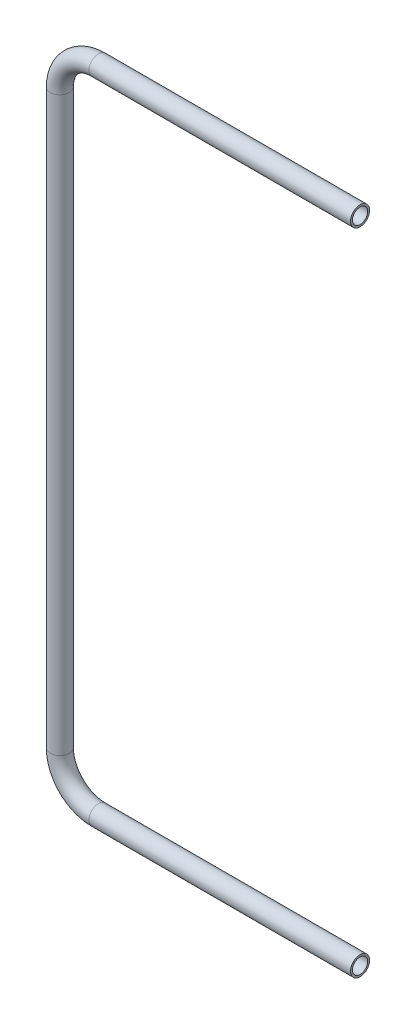
ISO-10303-21;
HEADER;
FILE_DESCRIPTION(('STEP AP214'),'2;1');
FILE_NAME('part.step','',(''),(''),'','','');
FILE_SCHEMA(('AUTOMOTIVE_DESIGN { 1 0 10303 214 1 1 1 1 }'));
ENDSEC;
DATA;
#1=APPLICATION_CONTEXT('core data for automotive mechanical design processes');
#2=APPLICATION_PROTOCOL_DEFINITION('international standard','automotive_design',2000,#1);
#3=PRODUCT_CONTEXT('',#1,'mechanical');
#4=PRODUCT('Part','Part','',(#3));
#5=PRODUCT_RELATED_PRODUCT_CATEGORY('part','',(#4));
#6=PRODUCT_DEFINITION_FORMATION('','',#4);
#7=PRODUCT_DEFINITION_CONTEXT('part definition',#1,'design');
#8=PRODUCT_DEFINITION('design','',#6,#7);
#9=PRODUCT_DEFINITION_SHAPE('','',#8);
#10=(LENGTH_UNIT() NAMED_UNIT(*) SI_UNIT(.MILLI.,.METRE.));
#11=(NAMED_UNIT(*) PLANE_ANGLE_UNIT() SI_UNIT($,.RADIAN.));
#12=(NAMED_UNIT(*) SI_UNIT($,.STERADIAN.) SOLID_ANGLE_UNIT());
#13=UNCERTAINTY_MEASURE_WITH_UNIT(LENGTH_MEASURE(1.E-05),#10,'distance_accuracy_value','');
#14=(GEOMETRIC_REPRESENTATION_CONTEXT(3) GLOBAL_UNCERTAINTY_ASSIGNED_CONTEXT((#13)) GLOBAL_UNIT_ASSIGNED_CONTEXT((#10,
#11,#12)) REPRESENTATION_CONTEXT('',''));
#15=CARTESIAN_POINT('',(0.,0.,0.));
#16=DIRECTION('',(0.,0.,1.));
#17=DIRECTION('',(1.,0.,0.));
#18=AXIS2_PLACEMENT_3D('',#15,#16,#17);
#19=CARTESIAN_POINT('',(0.,0.,0.));
#20=DIRECTION('',(-1.,0.,0.));
#21=DIRECTION('',(0.,-1.,0.));
#22=AXIS2_PLACEMENT_3D('',#19,#20,#21);
#23=CYLINDRICAL_SURFACE('',#22,16.7005);
#24=CARTESIAN_POINT('',(-457.2,0.,0.));
#25=DIRECTION('',(1.,0.,0.));
#26=DIRECTION('',(0.,0.,-1.));
#27=AXIS2_PLACEMENT_3D('',#24,#25,#26);
#28=CIRCLE('',#27,16.7005);
#29=CARTESIAN_POINT('',(-457.2,-16.7005000000001,0.));
#30=VERTEX_POINT('',#29);
#31=EDGE_CURVE('E113',#30,#30,#28,.T.);
#32=ORIENTED_EDGE('',*,*,#31,.T.);
#33=EDGE_LOOP('',(#32));
#34=FACE_BOUND('',#33,.T.);
#35=CARTESIAN_POINT('',(0.,0.,0.));
#36=DIRECTION('',(1.,0.,0.));
#37=DIRECTION('',(0.,0.,-1.));
#38=AXIS2_PLACEMENT_3D('',#35,#36,#37);
#39=CIRCLE('',#38,16.7005);
#40=CARTESIAN_POINT('',(0.,0.,-16.7005));
#41=VERTEX_POINT('',#40);
#42=EDGE_CURVE('E47',#41,#41,#39,.T.);
#43=ORIENTED_EDGE('',*,*,#42,.F.);
#44=EDGE_LOOP('',(#43));
#45=FACE_BOUND('',#44,.T.);
#46=ADVANCED_FACE('F32',(#34,#45),#23,.T.);
#47=CARTESIAN_POINT('',(-457.2,67.5005,0.));
#48=DIRECTION('',(0.,0.,-1.));
#49=DIRECTION('',(-1.,0.,0.));
#50=AXIS2_PLACEMENT_3D('',#47,#48,#49);
#51=TOROIDAL_SURFACE('',#50,67.5005,16.7005);
#52=CARTESIAN_POINT('',(-524.7005,67.5005,0.));
#53=DIRECTION('',(0.,-1.,0.));
#54=DIRECTION('',(0.,0.,-1.));
#55=AXIS2_PLACEMENT_3D('',#52,#53,#54);
#56=CIRCLE('',#55,16.7005);
#57=CARTESIAN_POINT('',(-541.401,67.5005,0.));
#58=VERTEX_POINT('',#57);
#59=EDGE_CURVE('E116',#58,#58,#56,.T.);
#60=CARTESIAN_POINT('',(-457.2,67.5005,0.));
#61=DIRECTION('',(0.,0.,-1.));
#62=DIRECTION('',(-1.,0.,0.));
#63=AXIS2_PLACEMENT_3D('',#60,#61,#62);
#64=CIRCLE('',#63,84.201);
#65=EDGE_CURVE('',#30,#58,#64,.T.);
#66=ORIENTED_EDGE('',*,*,#31,.F.);
#67=ORIENTED_EDGE('',*,*,#59,.T.);
#68=ORIENTED_EDGE('',*,*,#65,.T.);
#69=ORIENTED_EDGE('',*,*,#65,.F.);
#70=EDGE_LOOP('',(#66,#68,#67,#69));
#71=FACE_BOUND('',#70,.T.);
#72=ADVANCED_FACE('F137',(#71),#51,.T.);
#73=CARTESIAN_POINT('',(-524.7005,67.5005,0.));
#74=DIRECTION('',(0.,1.,0.));
#75=DIRECTION('',(-1.,0.,0.));
#76=AXIS2_PLACEMENT_3D('',#73,#74,#75);
#77=CYLINDRICAL_SURFACE('',#76,16.7005);
#78=CARTESIAN_POINT('',(-524.7005,1067.562,0.));
#79=DIRECTION('',(0.,-1.,0.));
#80=DIRECTION('',(0.,0.,-1.));
#81=AXIS2_PLACEMENT_3D('',#78,#79,#80);
#82=CIRCLE('',#81,16.7005);
#83=CARTESIAN_POINT('',(-541.401,1067.562,0.));
#84=VERTEX_POINT('',#83);
#85=EDGE_CURVE('E118',#84,#84,#82,.T.);
#86=ORIENTED_EDGE('',*,*,#85,.T.);
#87=EDGE_LOOP('',(#86));
#88=FACE_BOUND('',#87,.T.);
#89=ORIENTED_EDGE('',*,*,#59,.F.);
#90=EDGE_LOOP('',(#89));
#91=FACE_BOUND('',#90,.T.);
#92=ADVANCED_FACE('F133',(#88,#91),#77,.T.);
#93=CARTESIAN_POINT('',(-457.2,1067.562,0.));
#94=DIRECTION('',(0.,0.,-1.));
#95=DIRECTION('',(-1.,0.,0.));
#96=AXIS2_PLACEMENT_3D('',#93,#94,#95);
#97=TOROIDAL_SURFACE('',#96,67.5005,16.7005);
#98=CARTESIAN_POINT('',(-457.2,1135.0625,0.));
#99=DIRECTION('',(-1.,0.,0.));
#100=DIRECTION('',(0.,0.,-1.));
#101=AXIS2_PLACEMENT_3D('',#98,#99,#100);
#102=CIRCLE('',#101,16.7005);
#103=CARTESIAN_POINT('',(-457.2,1151.763,0.));
#104=VERTEX_POINT('',#103);
#105=EDGE_CURVE('E36',#104,#104,#102,.T.);
#106=CARTESIAN_POINT('',(-457.2,1067.562,0.));
#107=DIRECTION('',(0.,0.,-1.));
#108=DIRECTION('',(-1.,0.,0.));
#109=AXIS2_PLACEMENT_3D('',#106,#107,#108);
#110=CIRCLE('',#109,84.201);
#111=EDGE_CURVE('',#84,#104,#110,.T.);
#112=ORIENTED_EDGE('',*,*,#85,.F.);
#113=ORIENTED_EDGE('',*,*,#105,.T.);
#114=ORIENTED_EDGE('',*,*,#111,.T.);
#115=ORIENTED_EDGE('',*,*,#111,.F.);
#116=EDGE_LOOP('',(#112,#114,#113,#115));
#117=FACE_BOUND('',#116,.T.);
#118=ADVANCED_FACE('F125',(#117),#97,.T.);
#119=CARTESIAN_POINT('',(-457.2,1135.0625,0.));
#120=DIRECTION('',(1.,0.,0.));
#121=DIRECTION('',(0.,1.,0.));
#122=AXIS2_PLACEMENT_3D('',#119,#120,#121);
#123=CYLINDRICAL_SURFACE('',#122,16.7005);
#124=CARTESIAN_POINT('',(-3.33066907387547E-13,1135.0625,0.));
#125=DIRECTION('',(-1.,0.,0.));
#126=DIRECTION('',(0.,0.,-1.));
#127=AXIS2_PLACEMENT_3D('',#124,#125,#126);
#128=CIRCLE('',#127,16.7005);
#129=CARTESIAN_POINT('',(-3.33066907387547E-13,1135.0625,-16.7005));
#130=VERTEX_POINT('',#129);
#131=EDGE_CURVE('E52',#130,#130,#128,.T.);
#132=ORIENTED_EDGE('',*,*,#131,.T.);
#133=EDGE_LOOP('',(#132));
#134=FACE_BOUND('',#133,.T.);
#135=ORIENTED_EDGE('',*,*,#105,.F.);
#136=EDGE_LOOP('',(#135));
#137=FACE_BOUND('',#136,.T.);
#138=ADVANCED_FACE('F34',(#134,#137),#123,.T.);
#139=CARTESIAN_POINT('',(0.,0.,0.));
#140=DIRECTION('',(1.,0.,0.));
#141=DIRECTION('',(0.,0.,-1.));
#142=AXIS2_PLACEMENT_3D('',#139,#140,#141);
#143=PLANE('',#142);
#144=CARTESIAN_POINT('',(0.,0.,0.));
#145=DIRECTION('',(1.,0.,0.));
#146=DIRECTION('',(0.,0.,-1.));
#147=AXIS2_PLACEMENT_3D('',#144,#145,#146);
#148=CIRCLE('',#147,13.335);
#149=CARTESIAN_POINT('',(0.,0.,-13.335));
#150=VERTEX_POINT('',#149);
#151=EDGE_CURVE('E100',#150,#150,#148,.F.);
#152=ORIENTED_EDGE('',*,*,#151,.T.);
#153=EDGE_LOOP('',(#152));
#154=FACE_BOUND('',#153,.T.);
#155=ORIENTED_EDGE('',*,*,#42,.T.);
#156=EDGE_LOOP('',(#155));
#157=FACE_BOUND('',#156,.T.);
#158=ADVANCED_FACE('F65',(#154,#157),#143,.T.);
#159=CARTESIAN_POINT('',(-3.33066907387547E-13,1135.0625,0.));
#160=DIRECTION('',(-1.,0.,0.));
#161=DIRECTION('',(0.,0.,-1.));
#162=AXIS2_PLACEMENT_3D('',#159,#160,#161);
#163=PLANE('',#162);
#164=CARTESIAN_POINT('',(-3.33066907387547E-13,1135.0625,0.));
#165=DIRECTION('',(-1.,0.,0.));
#166=DIRECTION('',(0.,0.,-1.));
#167=AXIS2_PLACEMENT_3D('',#164,#165,#166);
#168=CIRCLE('',#167,13.335);
#169=CARTESIAN_POINT('',(-3.33066907387547E-13,1135.0625,-13.335));
#170=VERTEX_POINT('',#169);
#171=EDGE_CURVE('E11',#170,#170,#168,.F.);
#172=ORIENTED_EDGE('',*,*,#171,.F.);
#173=EDGE_LOOP('',(#172));
#174=FACE_BOUND('',#173,.T.);
#175=ORIENTED_EDGE('',*,*,#131,.F.);
#176=EDGE_LOOP('',(#175));
#177=FACE_BOUND('',#176,.T.);
#178=ADVANCED_FACE('F62',(#174,#177),#163,.F.);
#179=CARTESIAN_POINT('',(0.,0.,0.));
#180=DIRECTION('',(-1.,0.,0.));
#181=DIRECTION('',(0.,-1.,0.));
#182=AXIS2_PLACEMENT_3D('',#179,#180,#181);
#183=CYLINDRICAL_SURFACE('',#182,13.335);
#184=CARTESIAN_POINT('',(-457.2,0.,0.));
#185=DIRECTION('',(1.,0.,0.));
#186=DIRECTION('',(0.,0.,-1.));
#187=AXIS2_PLACEMENT_3D('',#184,#185,#186);
#188=CIRCLE('',#187,13.335);
#189=CARTESIAN_POINT('',(-457.2,-13.3350000000001,0.));
#190=VERTEX_POINT('',#189);
#191=EDGE_CURVE('E99',#190,#190,#188,.F.);
#192=ORIENTED_EDGE('',*,*,#191,.T.);
#193=EDGE_LOOP('',(#192));
#194=FACE_BOUND('',#193,.T.);
#195=ORIENTED_EDGE('',*,*,#151,.F.);
#196=EDGE_LOOP('',(#195));
#197=FACE_BOUND('',#196,.T.);
#198=ADVANCED_FACE('F64',(#194,#197),#183,.F.);
#199=CARTESIAN_POINT('',(-457.2,67.5005,0.));
#200=DIRECTION('',(0.,0.,-1.));
#201=DIRECTION('',(-1.,0.,0.));
#202=AXIS2_PLACEMENT_3D('',#199,#200,#201);
#203=TOROIDAL_SURFACE('',#202,67.5005,13.335);
#204=CARTESIAN_POINT('',(-524.7005,67.5005,0.));
#205=DIRECTION('',(0.,-1.,0.));
#206=DIRECTION('',(0.,0.,-1.));
#207=AXIS2_PLACEMENT_3D('',#204,#205,#206);
#208=CIRCLE('',#207,13.335);
#209=CARTESIAN_POINT('',(-538.0355,67.5005,0.));
#210=VERTEX_POINT('',#209);
#211=EDGE_CURVE('E96',#210,#210,#208,.F.);
#212=CARTESIAN_POINT('',(-457.2,67.5005,0.));
#213=DIRECTION('',(0.,0.,-1.));
#214=DIRECTION('',(-1.,0.,0.));
#215=AXIS2_PLACEMENT_3D('',#212,#213,#214);
#216=CIRCLE('',#215,80.8355);
#217=EDGE_CURVE('',#190,#210,#216,.T.);
#218=ORIENTED_EDGE('',*,*,#191,.F.);
#219=ORIENTED_EDGE('',*,*,#211,.T.);
#220=ORIENTED_EDGE('',*,*,#217,.T.);
#221=ORIENTED_EDGE('',*,*,#217,.F.);
#222=EDGE_LOOP('',(#218,#220,#219,#221));
#223=FACE_BOUND('',#222,.T.);
#224=ADVANCED_FACE('F71',(#223),#203,.F.);
#225=CARTESIAN_POINT('',(-524.7005,67.5005,0.));
#226=DIRECTION('',(0.,1.,0.));
#227=DIRECTION('',(-1.,0.,0.));
#228=AXIS2_PLACEMENT_3D('',#225,#226,#227);
#229=CYLINDRICAL_SURFACE('',#228,13.335);
#230=CARTESIAN_POINT('',(-524.7005,1067.562,0.));
#231=DIRECTION('',(0.,-1.,0.));
#232=DIRECTION('',(0.,0.,-1.));
#233=AXIS2_PLACEMENT_3D('',#230,#231,#232);
#234=CIRCLE('',#233,13.335);
#235=CARTESIAN_POINT('',(-538.0355,1067.562,0.));
#236=VERTEX_POINT('',#235);
#237=EDGE_CURVE('E102',#236,#236,#234,.F.);
#238=ORIENTED_EDGE('',*,*,#237,.T.);
#239=EDGE_LOOP('',(#238));
#240=FACE_BOUND('',#239,.T.);
#241=ORIENTED_EDGE('',*,*,#211,.F.);
#242=EDGE_LOOP('',(#241));
#243=FACE_BOUND('',#242,.T.);
#244=ADVANCED_FACE('F82',(#240,#243),#229,.F.);
#245=CARTESIAN_POINT('',(-457.2,1067.562,0.));
#246=DIRECTION('',(0.,0.,-1.));
#247=DIRECTION('',(-1.,0.,0.));
#248=AXIS2_PLACEMENT_3D('',#245,#246,#247);
#249=TOROIDAL_SURFACE('',#248,67.5005,13.335);
#250=CARTESIAN_POINT('',(-457.2,1135.0625,0.));
#251=DIRECTION('',(-1.,0.,0.));
#252=DIRECTION('',(0.,0.,-1.));
#253=AXIS2_PLACEMENT_3D('',#250,#251,#252);
#254=CIRCLE('',#253,13.335);
#255=CARTESIAN_POINT('',(-457.2,1148.3975,0.));
#256=VERTEX_POINT('',#255);
#257=EDGE_CURVE('E41',#256,#256,#254,.F.);
#258=CARTESIAN_POINT('',(-457.2,1067.562,0.));
#259=DIRECTION('',(0.,0.,-1.));
#260=DIRECTION('',(-1.,0.,0.));
#261=AXIS2_PLACEMENT_3D('',#258,#259,#260);
#262=CIRCLE('',#261,80.8355);
#263=EDGE_CURVE('',#236,#256,#262,.T.);
#264=ORIENTED_EDGE('',*,*,#237,.F.);
#265=ORIENTED_EDGE('',*,*,#257,.T.);
#266=ORIENTED_EDGE('',*,*,#263,.T.);
#267=ORIENTED_EDGE('',*,*,#263,.F.);
#268=EDGE_LOOP('',(#264,#266,#265,#267));
#269=FACE_BOUND('',#268,.T.);
#270=ADVANCED_FACE('F78',(#269),#249,.F.);
#271=CARTESIAN_POINT('',(-457.2,1135.0625,0.));
#272=DIRECTION('',(1.,0.,0.));
#273=DIRECTION('',(0.,1.,0.));
#274=AXIS2_PLACEMENT_3D('',#271,#272,#273);
#275=CYLINDRICAL_SURFACE('',#274,13.335);
#276=ORIENTED_EDGE('',*,*,#171,.T.);
#277=EDGE_LOOP('',(#276));
#278=FACE_BOUND('',#277,.T.);
#279=ORIENTED_EDGE('',*,*,#257,.F.);
#280=EDGE_LOOP('',(#279));
#281=FACE_BOUND('',#280,.T.);
#282=ADVANCED_FACE('F59',(#278,#281),#275,.F.);
#283=CLOSED_SHELL('',(#46,#72,#92,#118,#138,#158,#178,#198,#224,#244,#270,#282));
#284=MANIFOLD_SOLID_BREP('B2',#283);
#285=ADVANCED_BREP_SHAPE_REPRESENTATION('',(#18,#284),#14);
#286=SHAPE_DEFINITION_REPRESENTATION(#9,#285);
ENDSEC;
END-ISO-10303-21;
